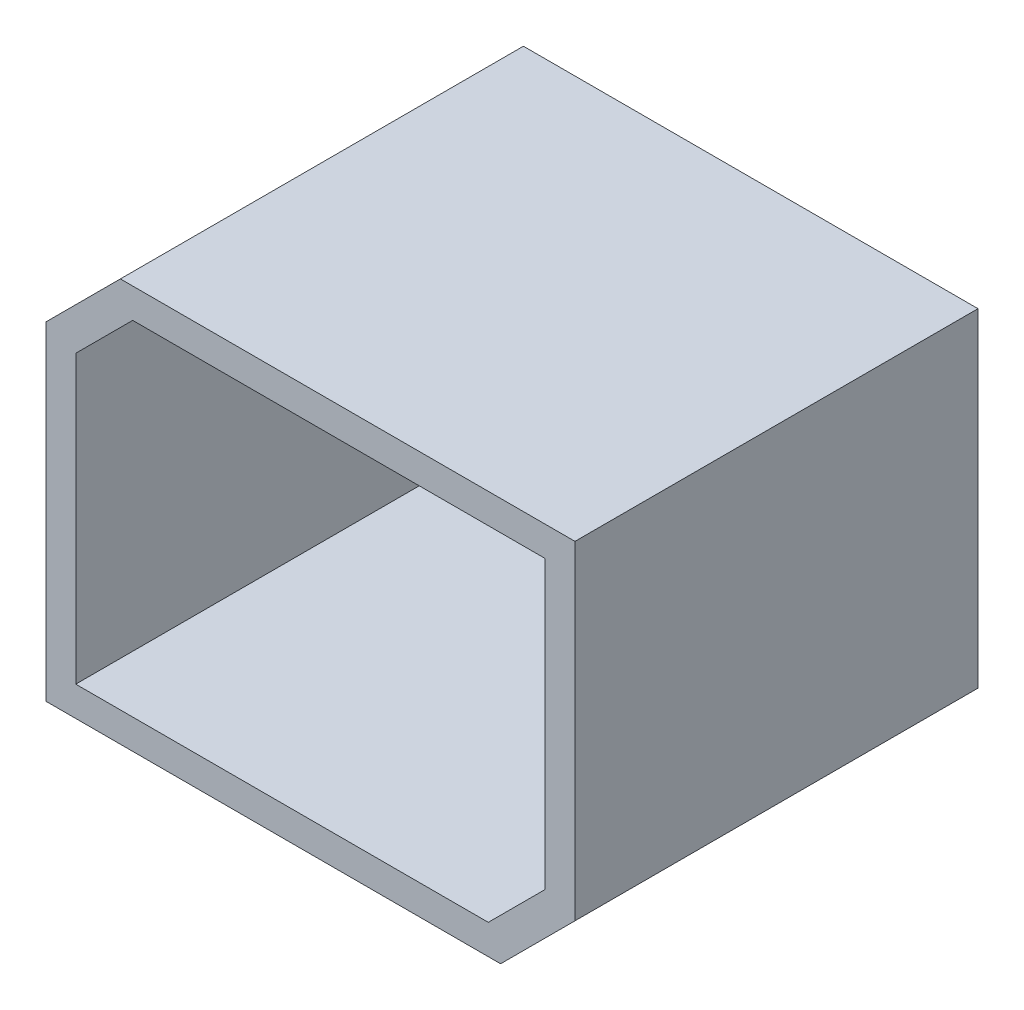
ISO-10303-21;
HEADER;
FILE_DESCRIPTION(('STEP AP214'),'2;1');
FILE_NAME('part.step','',(''),(''),'','','');
FILE_SCHEMA(('AUTOMOTIVE_DESIGN { 1 0 10303 214 1 1 1 1 }'));
ENDSEC;
DATA;
#1=APPLICATION_CONTEXT('core data for automotive mechanical design processes');
#2=APPLICATION_PROTOCOL_DEFINITION('international standard','automotive_design',2000,#1);
#3=PRODUCT_CONTEXT('',#1,'mechanical');
#4=PRODUCT('Part','Part','',(#3));
#5=PRODUCT_RELATED_PRODUCT_CATEGORY('part','',(#4));
#6=PRODUCT_DEFINITION_FORMATION('','',#4);
#7=PRODUCT_DEFINITION_CONTEXT('part definition',#1,'design');
#8=PRODUCT_DEFINITION('design','',#6,#7);
#9=PRODUCT_DEFINITION_SHAPE('','',#8);
#10=(LENGTH_UNIT() NAMED_UNIT(*) SI_UNIT(.MILLI.,.METRE.));
#11=(NAMED_UNIT(*) PLANE_ANGLE_UNIT() SI_UNIT($,.RADIAN.));
#12=(NAMED_UNIT(*) SI_UNIT($,.STERADIAN.) SOLID_ANGLE_UNIT());
#13=UNCERTAINTY_MEASURE_WITH_UNIT(LENGTH_MEASURE(1.E-05),#10,'distance_accuracy_value','');
#14=(GEOMETRIC_REPRESENTATION_CONTEXT(3) GLOBAL_UNCERTAINTY_ASSIGNED_CONTEXT((#13)) GLOBAL_UNIT_ASSIGNED_CONTEXT((#10,
#11,#12)) REPRESENTATION_CONTEXT('',''));
#15=CARTESIAN_POINT('',(0.,0.,0.));
#16=DIRECTION('',(0.,0.,1.));
#17=DIRECTION('',(1.,0.,0.));
#18=AXIS2_PLACEMENT_3D('',#15,#16,#17);
#19=CARTESIAN_POINT('',(0.,0.,81.28));
#20=DIRECTION('',(0.,0.,-1.));
#21=DIRECTION('',(-1.,0.,0.));
#22=AXIS2_PLACEMENT_3D('',#19,#20,#21);
#23=PLANE('',#22);
#24=DIRECTION('',(1.,0.,0.));
#25=VECTOR('',#24,1.);
#26=CARTESIAN_POINT('',(0.,0.,81.28));
#27=LINE('',#26,#25);
#28=CARTESIAN_POINT('',(0.,0.,81.28));
#29=VERTEX_POINT('',#28);
#30=CARTESIAN_POINT('',(91.6799999999999,0.,81.28));
#31=VERTEX_POINT('',#30);
#32=EDGE_CURVE('E201',#29,#31,#27,.T.);
#33=ORIENTED_EDGE('',*,*,#32,.T.);
#34=DIRECTION('',(-0.707106781186549,-0.707106781186546,0.));
#35=VECTOR('',#34,1.);
#36=CARTESIAN_POINT('',(106.68,15.,81.28));
#37=LINE('',#36,#35);
#38=CARTESIAN_POINT('',(106.68,15.,81.28));
#39=VERTEX_POINT('',#38);
#40=EDGE_CURVE('E247',#31,#39,#37,.F.);
#41=ORIENTED_EDGE('',*,*,#40,.T.);
#42=DIRECTION('',(0.,1.,0.));
#43=VECTOR('',#42,1.);
#44=CARTESIAN_POINT('',(106.68,0.,81.28));
#45=LINE('',#44,#43);
#46=CARTESIAN_POINT('',(106.68,81.28,81.28));
#47=VERTEX_POINT('',#46);
#48=EDGE_CURVE('E206',#39,#47,#45,.T.);
#49=ORIENTED_EDGE('',*,*,#48,.T.);
#50=DIRECTION('',(-1.,0.,0.));
#51=VECTOR('',#50,1.);
#52=CARTESIAN_POINT('',(0.,81.28,81.28));
#53=LINE('',#52,#51);
#54=CARTESIAN_POINT('',(15.0000000000001,81.28,81.28));
#55=VERTEX_POINT('',#54);
#56=EDGE_CURVE('E209',#47,#55,#53,.T.);
#57=ORIENTED_EDGE('',*,*,#56,.T.);
#58=DIRECTION('',(0.707106781186549,0.707106781186546,0.));
#59=VECTOR('',#58,1.);
#60=CARTESIAN_POINT('',(0.,66.28,81.28));
#61=LINE('',#60,#59);
#62=CARTESIAN_POINT('',(0.,66.28,81.28));
#63=VERTEX_POINT('',#62);
#64=EDGE_CURVE('E244',#55,#63,#61,.F.);
#65=ORIENTED_EDGE('',*,*,#64,.T.);
#66=DIRECTION('',(0.,-1.,0.));
#67=VECTOR('',#66,1.);
#68=CARTESIAN_POINT('',(0.,0.,81.28));
#69=LINE('',#68,#67);
#70=EDGE_CURVE('E198',#63,#29,#69,.T.);
#71=ORIENTED_EDGE('',*,*,#70,.T.);
#72=EDGE_LOOP('',(#33,#41,#49,#57,#65,#71));
#73=FACE_BOUND('',#72,.T.);
#74=DIRECTION('',(1.,0.,0.));
#75=VECTOR('',#74,1.);
#76=CARTESIAN_POINT('',(0.,6.,81.28));
#77=LINE('',#76,#75);
#78=CARTESIAN_POINT('',(6.,6.,81.28));
#79=VERTEX_POINT('',#78);
#80=CARTESIAN_POINT('',(89.1947186257614,6.,81.28));
#81=VERTEX_POINT('',#80);
#82=EDGE_CURVE('E184',#79,#81,#77,.T.);
#83=ORIENTED_EDGE('',*,*,#82,.F.);
#84=DIRECTION('',(0.,-1.,0.));
#85=VECTOR('',#84,1.);
#86=CARTESIAN_POINT('',(6.,0.,81.28));
#87=LINE('',#86,#85);
#88=CARTESIAN_POINT('',(6.,63.7947186257614,81.28));
#89=VERTEX_POINT('',#88);
#90=EDGE_CURVE('E151',#89,#79,#87,.T.);
#91=ORIENTED_EDGE('',*,*,#90,.F.);
#92=DIRECTION('',(0.707106781186549,0.707106781186546,0.));
#93=VECTOR('',#92,1.);
#94=CARTESIAN_POINT('',(4.24264068711928,62.0373593128807,81.28));
#95=LINE('',#94,#93);
#96=CARTESIAN_POINT('',(17.4852813742386,75.28,81.28));
#97=VERTEX_POINT('',#96);
#98=EDGE_CURVE('E167',#97,#89,#95,.F.);
#99=ORIENTED_EDGE('',*,*,#98,.F.);
#100=DIRECTION('',(-1.,0.,0.));
#101=VECTOR('',#100,1.);
#102=CARTESIAN_POINT('',(0.,75.28,81.28));
#103=LINE('',#102,#101);
#104=CARTESIAN_POINT('',(100.68,75.28,81.28));
#105=VERTEX_POINT('',#104);
#106=EDGE_CURVE('E161',#105,#97,#103,.T.);
#107=ORIENTED_EDGE('',*,*,#106,.F.);
#108=DIRECTION('',(0.,1.,0.));
#109=VECTOR('',#108,1.);
#110=CARTESIAN_POINT('',(100.68,0.,81.28));
#111=LINE('',#110,#109);
#112=CARTESIAN_POINT('',(100.68,17.4852813742386,81.28));
#113=VERTEX_POINT('',#112);
#114=EDGE_CURVE('E187',#113,#105,#111,.T.);
#115=ORIENTED_EDGE('',*,*,#114,.F.);
#116=DIRECTION('',(-0.707106781186549,-0.707106781186546,0.));
#117=VECTOR('',#116,1.);
#118=CARTESIAN_POINT('',(102.437359312881,19.2426406871193,81.28));
#119=LINE('',#118,#117);
#120=EDGE_CURVE('E188',#81,#113,#119,.F.);
#121=ORIENTED_EDGE('',*,*,#120,.F.);
#122=EDGE_LOOP('',(#83,#91,#99,#107,#115,#121));
#123=FACE_BOUND('',#122,.T.);
#124=ADVANCED_FACE('F39',(#73,#123),#23,.F.);
#125=CARTESIAN_POINT('',(0.,0.,81.28));
#126=DIRECTION('',(1.,0.,0.));
#127=DIRECTION('',(0.,0.,-1.));
#128=AXIS2_PLACEMENT_3D('',#125,#126,#127);
#129=PLANE('',#128);
#130=ORIENTED_EDGE('',*,*,#70,.F.);
#131=DIRECTION('',(0.,0.,-1.));
#132=VECTOR('',#131,1.);
#133=CARTESIAN_POINT('',(0.,66.28,81.28));
#134=LINE('',#133,#132);
#135=CARTESIAN_POINT('',(0.,66.28,0.));
#136=VERTEX_POINT('',#135);
#137=EDGE_CURVE('E48',#63,#136,#134,.T.);
#138=ORIENTED_EDGE('',*,*,#137,.T.);
#139=DIRECTION('',(0.,-1.,0.));
#140=VECTOR('',#139,1.);
#141=CARTESIAN_POINT('',(0.,0.,0.));
#142=LINE('',#141,#140);
#143=CARTESIAN_POINT('',(0.,0.,0.));
#144=VERTEX_POINT('',#143);
#145=EDGE_CURVE('E181',#136,#144,#142,.T.);
#146=ORIENTED_EDGE('',*,*,#145,.T.);
#147=DIRECTION('',(0.,0.,-1.));
#148=VECTOR('',#147,1.);
#149=CARTESIAN_POINT('',(0.,0.,81.28));
#150=LINE('',#149,#148);
#151=EDGE_CURVE('E227',#29,#144,#150,.T.);
#152=ORIENTED_EDGE('',*,*,#151,.F.);
#153=EDGE_LOOP('',(#130,#138,#146,#152));
#154=FACE_BOUND('',#153,.T.);
#155=ADVANCED_FACE('F255',(#154),#129,.F.);
#156=CARTESIAN_POINT('',(0.,0.,81.28));
#157=DIRECTION('',(0.,1.,0.));
#158=DIRECTION('',(0.,0.,1.));
#159=AXIS2_PLACEMENT_3D('',#156,#157,#158);
#160=PLANE('',#159);
#161=DIRECTION('',(1.,0.,0.));
#162=VECTOR('',#161,1.);
#163=CARTESIAN_POINT('',(0.,0.,0.));
#164=LINE('',#163,#162);
#165=CARTESIAN_POINT('',(91.6799999999999,0.,0.));
#166=VERTEX_POINT('',#165);
#167=EDGE_CURVE('E215',#144,#166,#164,.T.);
#168=ORIENTED_EDGE('',*,*,#167,.T.);
#169=DIRECTION('',(0.,0.,1.));
#170=VECTOR('',#169,1.);
#171=CARTESIAN_POINT('',(91.6799999999999,0.,81.28));
#172=LINE('',#171,#170);
#173=EDGE_CURVE('E241',#166,#31,#172,.T.);
#174=ORIENTED_EDGE('',*,*,#173,.T.);
#175=ORIENTED_EDGE('',*,*,#32,.F.);
#176=ORIENTED_EDGE('',*,*,#151,.T.);
#177=EDGE_LOOP('',(#168,#174,#175,#176));
#178=FACE_BOUND('',#177,.T.);
#179=ADVANCED_FACE('F267',(#178),#160,.F.);
#180=CARTESIAN_POINT('',(106.68,0.,81.28));
#181=DIRECTION('',(-1.,0.,0.));
#182=DIRECTION('',(0.,0.,1.));
#183=AXIS2_PLACEMENT_3D('',#180,#181,#182);
#184=PLANE('',#183);
#185=ORIENTED_EDGE('',*,*,#48,.F.);
#186=DIRECTION('',(0.,0.,-1.));
#187=VECTOR('',#186,1.);
#188=CARTESIAN_POINT('',(106.68,15.,81.28));
#189=LINE('',#188,#187);
#190=CARTESIAN_POINT('',(106.68,15.,0.));
#191=VERTEX_POINT('',#190);
#192=EDGE_CURVE('E231',#39,#191,#189,.T.);
#193=ORIENTED_EDGE('',*,*,#192,.T.);
#194=DIRECTION('',(0.,1.,0.));
#195=VECTOR('',#194,1.);
#196=CARTESIAN_POINT('',(106.68,0.,0.));
#197=LINE('',#196,#195);
#198=CARTESIAN_POINT('',(106.68,81.28,0.));
#199=VERTEX_POINT('',#198);
#200=EDGE_CURVE('E219',#191,#199,#197,.T.);
#201=ORIENTED_EDGE('',*,*,#200,.T.);
#202=DIRECTION('',(0.,0.,-1.));
#203=VECTOR('',#202,1.);
#204=CARTESIAN_POINT('',(106.68,81.28,81.28));
#205=LINE('',#204,#203);
#206=EDGE_CURVE('E212',#47,#199,#205,.T.);
#207=ORIENTED_EDGE('',*,*,#206,.F.);
#208=EDGE_LOOP('',(#185,#193,#201,#207));
#209=FACE_BOUND('',#208,.T.);
#210=ADVANCED_FACE('F276',(#209),#184,.F.);
#211=CARTESIAN_POINT('',(0.,81.28,81.28));
#212=DIRECTION('',(0.,-1.,0.));
#213=DIRECTION('',(0.,0.,-1.));
#214=AXIS2_PLACEMENT_3D('',#211,#212,#213);
#215=PLANE('',#214);
#216=DIRECTION('',(-1.,0.,0.));
#217=VECTOR('',#216,1.);
#218=CARTESIAN_POINT('',(0.,81.28,0.));
#219=LINE('',#218,#217);
#220=CARTESIAN_POINT('',(15.0000000000001,81.28,0.));
#221=VERTEX_POINT('',#220);
#222=EDGE_CURVE('E202',#199,#221,#219,.T.);
#223=ORIENTED_EDGE('',*,*,#222,.T.);
#224=DIRECTION('',(0.,0.,1.));
#225=VECTOR('',#224,1.);
#226=CARTESIAN_POINT('',(15.0000000000001,81.28,81.28));
#227=LINE('',#226,#225);
#228=EDGE_CURVE('E11',#221,#55,#227,.T.);
#229=ORIENTED_EDGE('',*,*,#228,.T.);
#230=ORIENTED_EDGE('',*,*,#56,.F.);
#231=ORIENTED_EDGE('',*,*,#206,.T.);
#232=EDGE_LOOP('',(#223,#229,#230,#231));
#233=FACE_BOUND('',#232,.T.);
#234=ADVANCED_FACE('F278',(#233),#215,.F.);
#235=CARTESIAN_POINT('',(0.,0.,0.));
#236=DIRECTION('',(0.,0.,-1.));
#237=DIRECTION('',(-1.,0.,0.));
#238=AXIS2_PLACEMENT_3D('',#235,#236,#237);
#239=PLANE('',#238);
#240=ORIENTED_EDGE('',*,*,#200,.F.);
#241=DIRECTION('',(0.707106781186549,0.707106781186546,0.));
#242=VECTOR('',#241,1.);
#243=CARTESIAN_POINT('',(45.8399999999998,-45.84,0.));
#244=LINE('',#243,#242);
#245=EDGE_CURVE('E238',#191,#166,#244,.F.);
#246=ORIENTED_EDGE('',*,*,#245,.T.);
#247=ORIENTED_EDGE('',*,*,#167,.F.);
#248=ORIENTED_EDGE('',*,*,#145,.F.);
#249=DIRECTION('',(-0.707106781186549,-0.707106781186546,0.));
#250=VECTOR('',#249,1.);
#251=CARTESIAN_POINT('',(-33.14,33.1400000000001,0.));
#252=LINE('',#251,#250);
#253=EDGE_CURVE('E235',#136,#221,#252,.F.);
#254=ORIENTED_EDGE('',*,*,#253,.T.);
#255=ORIENTED_EDGE('',*,*,#222,.F.);
#256=EDGE_LOOP('',(#240,#246,#247,#248,#254,#255));
#257=FACE_BOUND('',#256,.T.);
#258=ADVANCED_FACE('F262',(#257),#239,.T.);
#259=CARTESIAN_POINT('',(106.68,15.,81.28));
#260=DIRECTION('',(-0.707106781186546,0.707106781186549,0.));
#261=DIRECTION('',(0.,0.,-1.));
#262=AXIS2_PLACEMENT_3D('',#259,#260,#261);
#263=PLANE('',#262);
#264=ORIENTED_EDGE('',*,*,#40,.F.);
#265=ORIENTED_EDGE('',*,*,#173,.F.);
#266=ORIENTED_EDGE('',*,*,#245,.F.);
#267=ORIENTED_EDGE('',*,*,#192,.F.);
#268=EDGE_LOOP('',(#264,#265,#266,#267));
#269=FACE_BOUND('',#268,.T.);
#270=ADVANCED_FACE('F274',(#269),#263,.F.);
#271=CARTESIAN_POINT('',(0.,66.28,81.28));
#272=DIRECTION('',(0.707106781186546,-0.707106781186549,0.));
#273=DIRECTION('',(0.,0.,-1.));
#274=AXIS2_PLACEMENT_3D('',#271,#272,#273);
#275=PLANE('',#274);
#276=ORIENTED_EDGE('',*,*,#64,.F.);
#277=ORIENTED_EDGE('',*,*,#228,.F.);
#278=ORIENTED_EDGE('',*,*,#253,.F.);
#279=ORIENTED_EDGE('',*,*,#137,.F.);
#280=EDGE_LOOP('',(#276,#277,#278,#279));
#281=FACE_BOUND('',#280,.T.);
#282=ADVANCED_FACE('F41',(#281),#275,.F.);
#283=CARTESIAN_POINT('',(6.,0.,81.28));
#284=DIRECTION('',(1.,0.,0.));
#285=DIRECTION('',(0.,0.,-1.));
#286=AXIS2_PLACEMENT_3D('',#283,#284,#285);
#287=PLANE('',#286);
#288=ORIENTED_EDGE('',*,*,#90,.T.);
#289=DIRECTION('',(0.,0.,-1.));
#290=VECTOR('',#289,1.);
#291=CARTESIAN_POINT('',(6.,6.,81.28));
#292=LINE('',#291,#290);
#293=CARTESIAN_POINT('',(6.,6.,6.));
#294=VERTEX_POINT('',#293);
#295=EDGE_CURVE('E143',#79,#294,#292,.T.);
#296=ORIENTED_EDGE('',*,*,#295,.T.);
#297=DIRECTION('',(0.,-1.,0.));
#298=VECTOR('',#297,1.);
#299=CARTESIAN_POINT('',(6.,0.,6.));
#300=LINE('',#299,#298);
#301=CARTESIAN_POINT('',(6.,63.7947186257614,6.));
#302=VERTEX_POINT('',#301);
#303=EDGE_CURVE('E129',#302,#294,#300,.T.);
#304=ORIENTED_EDGE('',*,*,#303,.F.);
#305=DIRECTION('',(0.,0.,1.));
#306=VECTOR('',#305,1.);
#307=CARTESIAN_POINT('',(6.,63.7947186257614,81.28));
#308=LINE('',#307,#306);
#309=EDGE_CURVE('E55',#89,#302,#308,.F.);
#310=ORIENTED_EDGE('',*,*,#309,.F.);
#311=EDGE_LOOP('',(#288,#296,#304,#310));
#312=FACE_BOUND('',#311,.T.);
#313=ADVANCED_FACE('F149',(#312),#287,.T.);
#314=CARTESIAN_POINT('',(0.,6.,81.28));
#315=DIRECTION('',(0.,1.,0.));
#316=DIRECTION('',(0.,0.,1.));
#317=AXIS2_PLACEMENT_3D('',#314,#315,#316);
#318=PLANE('',#317);
#319=DIRECTION('',(1.,0.,0.));
#320=VECTOR('',#319,1.);
#321=CARTESIAN_POINT('',(0.,6.,6.));
#322=LINE('',#321,#320);
#323=CARTESIAN_POINT('',(89.1947186257614,6.,6.));
#324=VERTEX_POINT('',#323);
#325=EDGE_CURVE('E132',#294,#324,#322,.T.);
#326=ORIENTED_EDGE('',*,*,#325,.F.);
#327=ORIENTED_EDGE('',*,*,#295,.F.);
#328=ORIENTED_EDGE('',*,*,#82,.T.);
#329=DIRECTION('',(0.,0.,-1.));
#330=VECTOR('',#329,1.);
#331=CARTESIAN_POINT('',(89.1947186257614,6.,81.28));
#332=LINE('',#331,#330);
#333=EDGE_CURVE('E145',#324,#81,#332,.F.);
#334=ORIENTED_EDGE('',*,*,#333,.F.);
#335=EDGE_LOOP('',(#326,#327,#328,#334));
#336=FACE_BOUND('',#335,.T.);
#337=ADVANCED_FACE('F141',(#336),#318,.T.);
#338=CARTESIAN_POINT('',(100.68,0.,81.28));
#339=DIRECTION('',(-1.,0.,0.));
#340=DIRECTION('',(0.,0.,1.));
#341=AXIS2_PLACEMENT_3D('',#338,#339,#340);
#342=PLANE('',#341);
#343=ORIENTED_EDGE('',*,*,#114,.T.);
#344=DIRECTION('',(0.,0.,-1.));
#345=VECTOR('',#344,1.);
#346=CARTESIAN_POINT('',(100.68,75.28,81.28));
#347=LINE('',#346,#345);
#348=CARTESIAN_POINT('',(100.68,75.28,6.));
#349=VERTEX_POINT('',#348);
#350=EDGE_CURVE('E154',#105,#349,#347,.T.);
#351=ORIENTED_EDGE('',*,*,#350,.T.);
#352=DIRECTION('',(0.,1.,0.));
#353=VECTOR('',#352,1.);
#354=CARTESIAN_POINT('',(100.68,0.,6.));
#355=LINE('',#354,#353);
#356=CARTESIAN_POINT('',(100.68,17.4852813742386,6.));
#357=VERTEX_POINT('',#356);
#358=EDGE_CURVE('E147',#357,#349,#355,.T.);
#359=ORIENTED_EDGE('',*,*,#358,.F.);
#360=DIRECTION('',(0.,0.,1.));
#361=VECTOR('',#360,1.);
#362=CARTESIAN_POINT('',(100.68,17.4852813742386,81.28));
#363=LINE('',#362,#361);
#364=EDGE_CURVE('E153',#113,#357,#363,.F.);
#365=ORIENTED_EDGE('',*,*,#364,.F.);
#366=EDGE_LOOP('',(#343,#351,#359,#365));
#367=FACE_BOUND('',#366,.T.);
#368=ADVANCED_FACE('F345',(#367),#342,.T.);
#369=CARTESIAN_POINT('',(0.,75.28,81.28));
#370=DIRECTION('',(0.,-1.,0.));
#371=DIRECTION('',(0.,0.,-1.));
#372=AXIS2_PLACEMENT_3D('',#369,#370,#371);
#373=PLANE('',#372);
#374=DIRECTION('',(-1.,0.,0.));
#375=VECTOR('',#374,1.);
#376=CARTESIAN_POINT('',(0.,75.28,6.));
#377=LINE('',#376,#375);
#378=CARTESIAN_POINT('',(17.4852813742386,75.28,6.));
#379=VERTEX_POINT('',#378);
#380=EDGE_CURVE('E171',#349,#379,#377,.T.);
#381=ORIENTED_EDGE('',*,*,#380,.F.);
#382=ORIENTED_EDGE('',*,*,#350,.F.);
#383=ORIENTED_EDGE('',*,*,#106,.T.);
#384=DIRECTION('',(0.,0.,-1.));
#385=VECTOR('',#384,1.);
#386=CARTESIAN_POINT('',(17.4852813742386,75.28,81.28));
#387=LINE('',#386,#385);
#388=EDGE_CURVE('E178',#379,#97,#387,.F.);
#389=ORIENTED_EDGE('',*,*,#388,.F.);
#390=EDGE_LOOP('',(#381,#382,#383,#389));
#391=FACE_BOUND('',#390,.T.);
#392=ADVANCED_FACE('F354',(#391),#373,.T.);
#393=CARTESIAN_POINT('',(0.,0.,6.));
#394=DIRECTION('',(0.,0.,-1.));
#395=DIRECTION('',(-1.,0.,0.));
#396=AXIS2_PLACEMENT_3D('',#393,#394,#395);
#397=PLANE('',#396);
#398=ORIENTED_EDGE('',*,*,#358,.T.);
#399=ORIENTED_EDGE('',*,*,#380,.T.);
#400=DIRECTION('',(-0.707106781186549,-0.707106781186546,0.));
#401=VECTOR('',#400,1.);
#402=CARTESIAN_POINT('',(-28.8973593128807,28.8973593128808,6.));
#403=LINE('',#402,#401);
#404=EDGE_CURVE('E135',#302,#379,#403,.F.);
#405=ORIENTED_EDGE('',*,*,#404,.F.);
#406=ORIENTED_EDGE('',*,*,#303,.T.);
#407=ORIENTED_EDGE('',*,*,#325,.T.);
#408=DIRECTION('',(0.707106781186549,0.707106781186546,0.));
#409=VECTOR('',#408,1.);
#410=CARTESIAN_POINT('',(41.5973593128805,-41.5973593128807,6.));
#411=LINE('',#410,#409);
#412=EDGE_CURVE('E168',#357,#324,#411,.F.);
#413=ORIENTED_EDGE('',*,*,#412,.F.);
#414=EDGE_LOOP('',(#398,#399,#405,#406,#407,#413));
#415=FACE_BOUND('',#414,.T.);
#416=ADVANCED_FACE('F131',(#415),#397,.F.);
#417=CARTESIAN_POINT('',(102.437359312881,19.2426406871193,81.28));
#418=DIRECTION('',(-0.707106781186546,0.707106781186549,0.));
#419=DIRECTION('',(0.,0.,-1.));
#420=AXIS2_PLACEMENT_3D('',#417,#418,#419);
#421=PLANE('',#420);
#422=ORIENTED_EDGE('',*,*,#120,.T.);
#423=ORIENTED_EDGE('',*,*,#364,.T.);
#424=ORIENTED_EDGE('',*,*,#412,.T.);
#425=ORIENTED_EDGE('',*,*,#333,.T.);
#426=EDGE_LOOP('',(#422,#423,#424,#425));
#427=FACE_BOUND('',#426,.T.);
#428=ADVANCED_FACE('F373',(#427),#421,.T.);
#429=CARTESIAN_POINT('',(4.24264068711928,62.0373593128807,81.28));
#430=DIRECTION('',(0.707106781186546,-0.707106781186549,0.));
#431=DIRECTION('',(0.,0.,-1.));
#432=AXIS2_PLACEMENT_3D('',#429,#430,#431);
#433=PLANE('',#432);
#434=ORIENTED_EDGE('',*,*,#98,.T.);
#435=ORIENTED_EDGE('',*,*,#309,.T.);
#436=ORIENTED_EDGE('',*,*,#404,.T.);
#437=ORIENTED_EDGE('',*,*,#388,.T.);
#438=EDGE_LOOP('',(#434,#435,#436,#437));
#439=FACE_BOUND('',#438,.T.);
#440=ADVANCED_FACE('F293',(#439),#433,.T.);
#441=CLOSED_SHELL('',(#124,#155,#179,#210,#234,#258,#270,#282,#313,#337,#368,#392,#416,#428,#440));
#442=MANIFOLD_SOLID_BREP('B2',#441);
#443=ADVANCED_BREP_SHAPE_REPRESENTATION('',(#18,#442),#14);
#444=SHAPE_DEFINITION_REPRESENTATION(#9,#443);
ENDSEC;
END-ISO-10303-21;
